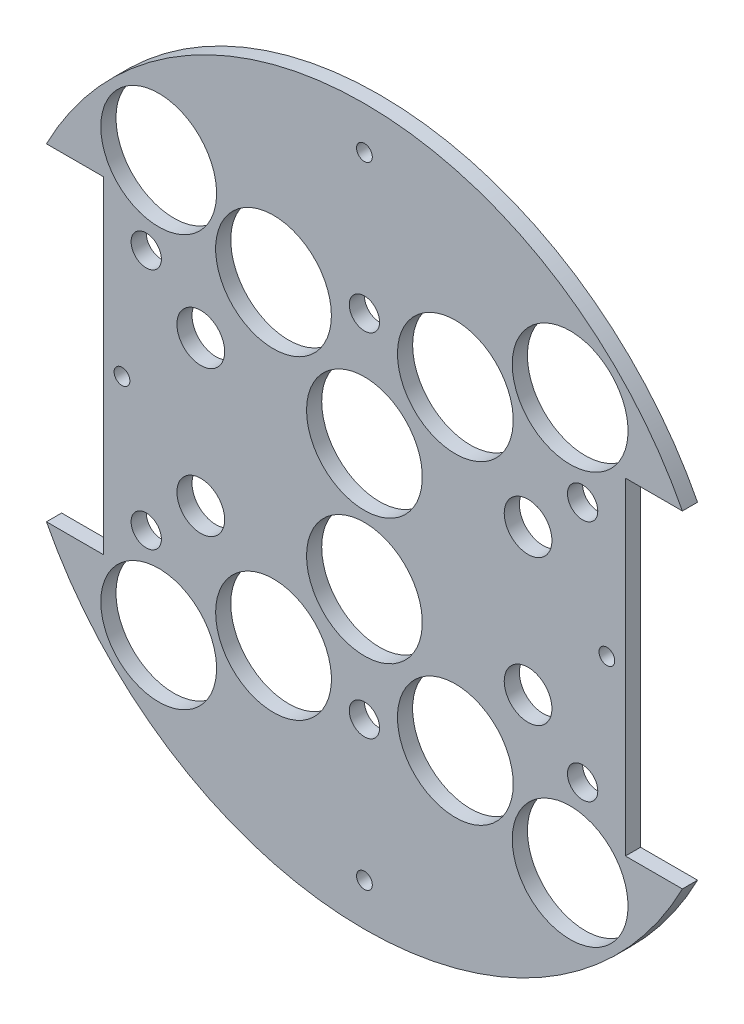
ISO-10303-21;
HEADER;
FILE_DESCRIPTION(('STEP AP214'),'2;1');
FILE_NAME('part.step','',(''),(''),'','','');
FILE_SCHEMA(('AUTOMOTIVE_DESIGN { 1 0 10303 214 1 1 1 1 }'));
ENDSEC;
DATA;
#1=APPLICATION_CONTEXT('core data for automotive mechanical design processes');
#2=APPLICATION_PROTOCOL_DEFINITION('international standard','automotive_design',2000,#1);
#3=PRODUCT_CONTEXT('',#1,'mechanical');
#4=PRODUCT('Part','Part','',(#3));
#5=PRODUCT_RELATED_PRODUCT_CATEGORY('part','',(#4));
#6=PRODUCT_DEFINITION_FORMATION('','',#4);
#7=PRODUCT_DEFINITION_CONTEXT('part definition',#1,'design');
#8=PRODUCT_DEFINITION('design','',#6,#7);
#9=PRODUCT_DEFINITION_SHAPE('','',#8);
#10=(LENGTH_UNIT() NAMED_UNIT(*) SI_UNIT(.MILLI.,.METRE.));
#11=(NAMED_UNIT(*) PLANE_ANGLE_UNIT() SI_UNIT($,.RADIAN.));
#12=(NAMED_UNIT(*) SI_UNIT($,.STERADIAN.) SOLID_ANGLE_UNIT());
#13=UNCERTAINTY_MEASURE_WITH_UNIT(LENGTH_MEASURE(1.E-05),#10,'distance_accuracy_value','');
#14=(GEOMETRIC_REPRESENTATION_CONTEXT(3) GLOBAL_UNCERTAINTY_ASSIGNED_CONTEXT((#13)) GLOBAL_UNIT_ASSIGNED_CONTEXT((#10,
#11,#12)) REPRESENTATION_CONTEXT('',''));
#15=CARTESIAN_POINT('',(0.,0.,0.));
#16=DIRECTION('',(0.,0.,1.));
#17=DIRECTION('',(1.,0.,0.));
#18=AXIS2_PLACEMENT_3D('',#15,#16,#17);
#19=CARTESIAN_POINT('',(0.,0.,3.175));
#20=DIRECTION('',(0.,0.,1.));
#21=DIRECTION('',(1.,0.,0.));
#22=AXIS2_PLACEMENT_3D('',#19,#20,#21);
#23=PLANE('',#22);
#24=CARTESIAN_POINT('',(0.,-66.04,3.175));
#25=DIRECTION('',(0.,0.,1.));
#26=DIRECTION('',(1.,0.,0.));
#27=AXIS2_PLACEMENT_3D('',#24,#25,#26);
#28=CIRCLE('',#27,1.65100000000002);
#29=CARTESIAN_POINT('',(1.65100000000002,-66.04,3.175));
#30=VERTEX_POINT('',#29);
#31=EDGE_CURVE('E161',#30,#30,#28,.T.);
#32=ORIENTED_EDGE('',*,*,#31,.F.);
#33=EDGE_LOOP('',(#32));
#34=FACE_BOUND('',#33,.T.);
#35=CARTESIAN_POINT('',(-50.8,0.,3.175));
#36=DIRECTION('',(0.,0.,1.));
#37=DIRECTION('',(1.,0.,0.));
#38=AXIS2_PLACEMENT_3D('',#35,#36,#37);
#39=CIRCLE('',#38,1.65100000000002);
#40=CARTESIAN_POINT('',(-49.149,0.,3.175));
#41=VERTEX_POINT('',#40);
#42=EDGE_CURVE('E167',#41,#41,#39,.T.);
#43=ORIENTED_EDGE('',*,*,#42,.F.);
#44=EDGE_LOOP('',(#43));
#45=FACE_BOUND('',#44,.T.);
#46=CARTESIAN_POINT('',(50.8,0.,3.175));
#47=DIRECTION('',(0.,0.,1.));
#48=DIRECTION('',(1.,0.,0.));
#49=AXIS2_PLACEMENT_3D('',#46,#47,#48);
#50=CIRCLE('',#49,1.65100000000002);
#51=CARTESIAN_POINT('',(52.451,0.,3.175));
#52=VERTEX_POINT('',#51);
#53=EDGE_CURVE('E164',#52,#52,#50,.T.);
#54=ORIENTED_EDGE('',*,*,#53,.F.);
#55=EDGE_LOOP('',(#54));
#56=FACE_BOUND('',#55,.T.);
#57=CARTESIAN_POINT('',(0.,66.04,3.175));
#58=DIRECTION('',(0.,0.,1.));
#59=DIRECTION('',(1.,0.,0.));
#60=AXIS2_PLACEMENT_3D('',#57,#58,#59);
#61=CIRCLE('',#60,1.65100000000002);
#62=CARTESIAN_POINT('',(1.65100000000002,66.04,3.175));
#63=VERTEX_POINT('',#62);
#64=EDGE_CURVE('E160',#63,#63,#61,.T.);
#65=ORIENTED_EDGE('',*,*,#64,.F.);
#66=EDGE_LOOP('',(#65));
#67=FACE_BOUND('',#66,.T.);
#68=CARTESIAN_POINT('',(0.,36.8300000000001,3.175));
#69=DIRECTION('',(0.,0.,1.));
#70=DIRECTION('',(1.,0.,0.));
#71=AXIS2_PLACEMENT_3D('',#68,#69,#70);
#72=CIRCLE('',#71,3.175);
#73=CARTESIAN_POINT('',(3.17499999999999,36.8300000000001,3.175));
#74=VERTEX_POINT('',#73);
#75=EDGE_CURVE('E208',#74,#74,#72,.T.);
#76=ORIENTED_EDGE('',*,*,#75,.F.);
#77=EDGE_LOOP('',(#76));
#78=FACE_BOUND('',#77,.T.);
#79=CARTESIAN_POINT('',(-45.72,25.4,3.175));
#80=DIRECTION('',(0.,0.,1.));
#81=DIRECTION('',(1.,0.,0.));
#82=AXIS2_PLACEMENT_3D('',#79,#80,#81);
#83=CIRCLE('',#82,3.175);
#84=CARTESIAN_POINT('',(-42.545,25.4,3.175));
#85=VERTEX_POINT('',#84);
#86=EDGE_CURVE('E205',#85,#85,#83,.T.);
#87=ORIENTED_EDGE('',*,*,#86,.F.);
#88=EDGE_LOOP('',(#87));
#89=FACE_BOUND('',#88,.T.);
#90=CARTESIAN_POINT('',(-45.72,-25.3999999999999,3.175));
#91=DIRECTION('',(0.,0.,1.));
#92=DIRECTION('',(1.,0.,0.));
#93=AXIS2_PLACEMENT_3D('',#90,#91,#92);
#94=CIRCLE('',#93,3.175);
#95=CARTESIAN_POINT('',(-42.545,-25.3999999999999,3.175));
#96=VERTEX_POINT('',#95);
#97=EDGE_CURVE('E202',#96,#96,#94,.T.);
#98=ORIENTED_EDGE('',*,*,#97,.F.);
#99=EDGE_LOOP('',(#98));
#100=FACE_BOUND('',#99,.T.);
#101=CARTESIAN_POINT('',(0.,-36.8299999999999,3.175));
#102=DIRECTION('',(0.,0.,1.));
#103=DIRECTION('',(1.,0.,0.));
#104=AXIS2_PLACEMENT_3D('',#101,#102,#103);
#105=CIRCLE('',#104,3.175);
#106=CARTESIAN_POINT('',(3.17499999999999,-36.8299999999999,3.175));
#107=VERTEX_POINT('',#106);
#108=EDGE_CURVE('E199',#107,#107,#105,.T.);
#109=ORIENTED_EDGE('',*,*,#108,.F.);
#110=EDGE_LOOP('',(#109));
#111=FACE_BOUND('',#110,.T.);
#112=CARTESIAN_POINT('',(45.72,-25.3999999999999,3.175));
#113=DIRECTION('',(0.,0.,1.));
#114=DIRECTION('',(1.,0.,0.));
#115=AXIS2_PLACEMENT_3D('',#112,#113,#114);
#116=CIRCLE('',#115,3.175);
#117=CARTESIAN_POINT('',(48.895,-25.3999999999999,3.175));
#118=VERTEX_POINT('',#117);
#119=EDGE_CURVE('E185',#118,#118,#116,.T.);
#120=ORIENTED_EDGE('',*,*,#119,.F.);
#121=EDGE_LOOP('',(#120));
#122=FACE_BOUND('',#121,.T.);
#123=CARTESIAN_POINT('',(45.72,25.4,3.175));
#124=DIRECTION('',(0.,0.,1.));
#125=DIRECTION('',(1.,0.,0.));
#126=AXIS2_PLACEMENT_3D('',#123,#124,#125);
#127=CIRCLE('',#126,3.175);
#128=CARTESIAN_POINT('',(48.895,25.4,3.175));
#129=VERTEX_POINT('',#128);
#130=EDGE_CURVE('E214',#129,#129,#127,.T.);
#131=ORIENTED_EDGE('',*,*,#130,.F.);
#132=EDGE_LOOP('',(#131));
#133=FACE_BOUND('',#132,.T.);
#134=CARTESIAN_POINT('',(34.29,-15.24,3.175));
#135=DIRECTION('',(0.,0.,-1.));
#136=DIRECTION('',(-1.,0.,0.));
#137=AXIS2_PLACEMENT_3D('',#134,#135,#136);
#138=CIRCLE('',#137,5.);
#139=CARTESIAN_POINT('',(29.29,-15.24,3.175));
#140=VERTEX_POINT('',#139);
#141=EDGE_CURVE('E218',#140,#140,#138,.T.);
#142=ORIENTED_EDGE('',*,*,#141,.T.);
#143=EDGE_LOOP('',(#142));
#144=FACE_BOUND('',#143,.T.);
#145=CARTESIAN_POINT('',(-34.29,15.24,3.175));
#146=DIRECTION('',(0.,0.,-1.));
#147=DIRECTION('',(-1.,0.,0.));
#148=AXIS2_PLACEMENT_3D('',#145,#146,#147);
#149=CIRCLE('',#148,5.);
#150=CARTESIAN_POINT('',(-39.29,15.24,3.175));
#151=VERTEX_POINT('',#150);
#152=EDGE_CURVE('E225',#151,#151,#149,.T.);
#153=ORIENTED_EDGE('',*,*,#152,.T.);
#154=EDGE_LOOP('',(#153));
#155=FACE_BOUND('',#154,.T.);
#156=CARTESIAN_POINT('',(34.29,15.24,3.175));
#157=DIRECTION('',(0.,0.,-1.));
#158=DIRECTION('',(-1.,0.,0.));
#159=AXIS2_PLACEMENT_3D('',#156,#157,#158);
#160=CIRCLE('',#159,5.);
#161=CARTESIAN_POINT('',(29.29,15.24,3.175));
#162=VERTEX_POINT('',#161);
#163=EDGE_CURVE('E231',#162,#162,#160,.T.);
#164=ORIENTED_EDGE('',*,*,#163,.T.);
#165=EDGE_LOOP('',(#164));
#166=FACE_BOUND('',#165,.T.);
#167=CARTESIAN_POINT('',(-34.29,-15.24,3.175));
#168=DIRECTION('',(0.,0.,-1.));
#169=DIRECTION('',(-1.,0.,0.));
#170=AXIS2_PLACEMENT_3D('',#167,#168,#169);
#171=CIRCLE('',#170,5.);
#172=CARTESIAN_POINT('',(-39.29,-15.24,3.175));
#173=VERTEX_POINT('',#172);
#174=EDGE_CURVE('E236',#173,#173,#171,.T.);
#175=ORIENTED_EDGE('',*,*,#174,.T.);
#176=EDGE_LOOP('',(#175));
#177=FACE_BOUND('',#176,.T.);
#178=CARTESIAN_POINT('',(-43.1052293811319,43.105229381132,3.175));
#179=DIRECTION('',(0.,0.,-1.));
#180=DIRECTION('',(-1.,0.,0.));
#181=AXIS2_PLACEMENT_3D('',#178,#179,#180);
#182=CIRCLE('',#181,12.1285);
#183=CARTESIAN_POINT('',(-55.2337293811319,43.105229381132,3.175));
#184=VERTEX_POINT('',#183);
#185=EDGE_CURVE('E260',#184,#184,#182,.T.);
#186=ORIENTED_EDGE('',*,*,#185,.T.);
#187=EDGE_LOOP('',(#186));
#188=FACE_BOUND('',#187,.T.);
#189=CARTESIAN_POINT('',(19.0500000000001,-32.9955678841871,3.175));
#190=DIRECTION('',(0.,0.,-1.));
#191=DIRECTION('',(1.,0.,0.));
#192=AXIS2_PLACEMENT_3D('',#189,#190,#191);
#193=CIRCLE('',#192,12.1285);
#194=CARTESIAN_POINT('',(31.1785000000001,-32.9955678841871,3.175));
#195=VERTEX_POINT('',#194);
#196=EDGE_CURVE('E267',#195,#195,#193,.T.);
#197=ORIENTED_EDGE('',*,*,#196,.T.);
#198=EDGE_LOOP('',(#197));
#199=FACE_BOUND('',#198,.T.);
#200=CARTESIAN_POINT('',(-43.105229381132,-43.1052293811318,3.175));
#201=DIRECTION('',(0.,0.,-1.));
#202=DIRECTION('',(-1.,0.,0.));
#203=AXIS2_PLACEMENT_3D('',#200,#201,#202);
#204=CIRCLE('',#203,12.1285);
#205=CARTESIAN_POINT('',(-55.233729381132,-43.1052293811318,3.175));
#206=VERTEX_POINT('',#205);
#207=EDGE_CURVE('E249',#206,#206,#204,.T.);
#208=ORIENTED_EDGE('',*,*,#207,.T.);
#209=EDGE_LOOP('',(#208));
#210=FACE_BOUND('',#209,.T.);
#211=CARTESIAN_POINT('',(0.,13.208,3.175));
#212=DIRECTION('',(0.,0.,-1.));
#213=DIRECTION('',(-1.,0.,0.));
#214=AXIS2_PLACEMENT_3D('',#211,#212,#213);
#215=CIRCLE('',#214,12.1285);
#216=CARTESIAN_POINT('',(-12.1285,13.208,3.175));
#217=VERTEX_POINT('',#216);
#218=EDGE_CURVE('E242',#217,#217,#215,.T.);
#219=ORIENTED_EDGE('',*,*,#218,.T.);
#220=EDGE_LOOP('',(#219));
#221=FACE_BOUND('',#220,.T.);
#222=CARTESIAN_POINT('',(0.,-13.208,3.175));
#223=DIRECTION('',(0.,0.,-1.));
#224=DIRECTION('',(-1.,0.,0.));
#225=AXIS2_PLACEMENT_3D('',#222,#223,#224);
#226=CIRCLE('',#225,12.1285);
#227=CARTESIAN_POINT('',(-12.1285,-13.208,3.175));
#228=VERTEX_POINT('',#227);
#229=EDGE_CURVE('E254',#228,#228,#226,.T.);
#230=ORIENTED_EDGE('',*,*,#229,.T.);
#231=EDGE_LOOP('',(#230));
#232=FACE_BOUND('',#231,.T.);
#233=CARTESIAN_POINT('',(43.1052293811319,-43.105229381132,3.175));
#234=DIRECTION('',(0.,0.,-1.));
#235=DIRECTION('',(-1.,0.,0.));
#236=AXIS2_PLACEMENT_3D('',#233,#234,#235);
#237=CIRCLE('',#236,12.1285);
#238=CARTESIAN_POINT('',(30.9767293811319,-43.105229381132,3.175));
#239=VERTEX_POINT('',#238);
#240=EDGE_CURVE('E284',#239,#239,#237,.T.);
#241=ORIENTED_EDGE('',*,*,#240,.T.);
#242=EDGE_LOOP('',(#241));
#243=FACE_BOUND('',#242,.T.);
#244=CARTESIAN_POINT('',(-19.0500000000001,32.9955678841871,3.175));
#245=DIRECTION('',(0.,0.,-1.));
#246=DIRECTION('',(1.,0.,0.));
#247=AXIS2_PLACEMENT_3D('',#244,#245,#246);
#248=CIRCLE('',#247,12.1285);
#249=CARTESIAN_POINT('',(-6.92150000000005,32.9955678841871,3.175));
#250=VERTEX_POINT('',#249);
#251=EDGE_CURVE('E291',#250,#250,#248,.T.);
#252=ORIENTED_EDGE('',*,*,#251,.T.);
#253=EDGE_LOOP('',(#252));
#254=FACE_BOUND('',#253,.T.);
#255=CARTESIAN_POINT('',(43.105229381132,43.1052293811319,3.175));
#256=DIRECTION('',(0.,0.,-1.));
#257=DIRECTION('',(-1.,0.,0.));
#258=AXIS2_PLACEMENT_3D('',#255,#256,#257);
#259=CIRCLE('',#258,12.1285);
#260=CARTESIAN_POINT('',(30.976729381132,43.1052293811319,3.175));
#261=VERTEX_POINT('',#260);
#262=EDGE_CURVE('E272',#261,#261,#259,.T.);
#263=ORIENTED_EDGE('',*,*,#262,.T.);
#264=EDGE_LOOP('',(#263));
#265=FACE_BOUND('',#264,.T.);
#266=CARTESIAN_POINT('',(19.0500000000001,32.9955678841871,3.175));
#267=DIRECTION('',(0.,0.,-1.));
#268=DIRECTION('',(-1.,0.,0.));
#269=AXIS2_PLACEMENT_3D('',#266,#267,#268);
#270=CIRCLE('',#269,12.1285);
#271=CARTESIAN_POINT('',(6.92150000000005,32.9955678841871,3.175));
#272=VERTEX_POINT('',#271);
#273=EDGE_CURVE('E278',#272,#272,#270,.T.);
#274=ORIENTED_EDGE('',*,*,#273,.T.);
#275=EDGE_LOOP('',(#274));
#276=FACE_BOUND('',#275,.T.);
#277=CARTESIAN_POINT('',(-19.0500000000001,-32.9955678841871,3.175));
#278=DIRECTION('',(0.,0.,-1.));
#279=DIRECTION('',(-1.,0.,0.));
#280=AXIS2_PLACEMENT_3D('',#277,#278,#279);
#281=CIRCLE('',#280,12.1285);
#282=CARTESIAN_POINT('',(-31.1785000000001,-32.9955678841871,3.175));
#283=VERTEX_POINT('',#282);
#284=EDGE_CURVE('E134',#283,#283,#281,.T.);
#285=ORIENTED_EDGE('',*,*,#284,.T.);
#286=EDGE_LOOP('',(#285));
#287=FACE_BOUND('',#286,.T.);
#288=CARTESIAN_POINT('',(0.,0.,3.175));
#289=DIRECTION('',(0.,0.,1.));
#290=DIRECTION('',(1.,0.,0.));
#291=AXIS2_PLACEMENT_3D('',#288,#289,#290);
#292=CIRCLE('',#291,74.93);
#293=CARTESIAN_POINT('',(66.6235754069083,34.29,3.175));
#294=VERTEX_POINT('',#293);
#295=CARTESIAN_POINT('',(-66.6235754069083,34.29,3.175));
#296=VERTEX_POINT('',#295);
#297=EDGE_CURVE('E145',#294,#296,#292,.T.);
#298=ORIENTED_EDGE('',*,*,#297,.T.);
#299=DIRECTION('',(1.,0.,0.));
#300=VECTOR('',#299,1.);
#301=CARTESIAN_POINT('',(-66.6235754069083,34.29,3.175));
#302=LINE('',#301,#300);
#303=CARTESIAN_POINT('',(-54.6855754069083,34.29,3.175));
#304=VERTEX_POINT('',#303);
#305=EDGE_CURVE('E94',#296,#304,#302,.T.);
#306=ORIENTED_EDGE('',*,*,#305,.T.);
#307=DIRECTION('',(0.,-1.,0.));
#308=VECTOR('',#307,1.);
#309=CARTESIAN_POINT('',(-54.6855754069083,34.29,3.175));
#310=LINE('',#309,#308);
#311=CARTESIAN_POINT('',(-54.6855754069083,-34.29,3.175));
#312=VERTEX_POINT('',#311);
#313=EDGE_CURVE('E302',#304,#312,#310,.T.);
#314=ORIENTED_EDGE('',*,*,#313,.T.);
#315=DIRECTION('',(-1.,0.,0.));
#316=VECTOR('',#315,1.);
#317=CARTESIAN_POINT('',(-66.6235754069083,-34.29,3.175));
#318=LINE('',#317,#316);
#319=CARTESIAN_POINT('',(-66.6235754069083,-34.29,3.175));
#320=VERTEX_POINT('',#319);
#321=EDGE_CURVE('E304',#312,#320,#318,.T.);
#322=ORIENTED_EDGE('',*,*,#321,.T.);
#323=CARTESIAN_POINT('',(0.,0.,3.175));
#324=DIRECTION('',(0.,0.,1.));
#325=DIRECTION('',(1.,0.,0.));
#326=AXIS2_PLACEMENT_3D('',#323,#324,#325);
#327=CIRCLE('',#326,74.93);
#328=CARTESIAN_POINT('',(66.6235754069083,-34.2900000000001,3.175));
#329=VERTEX_POINT('',#328);
#330=EDGE_CURVE('E112',#320,#329,#327,.T.);
#331=ORIENTED_EDGE('',*,*,#330,.T.);
#332=DIRECTION('',(-1.,0.,0.));
#333=VECTOR('',#332,1.);
#334=CARTESIAN_POINT('',(66.6235754069083,-34.29,3.175));
#335=LINE('',#334,#333);
#336=CARTESIAN_POINT('',(54.6855754069083,-34.29,3.175));
#337=VERTEX_POINT('',#336);
#338=EDGE_CURVE('E107',#329,#337,#335,.T.);
#339=ORIENTED_EDGE('',*,*,#338,.T.);
#340=DIRECTION('',(0.,1.,0.));
#341=VECTOR('',#340,1.);
#342=CARTESIAN_POINT('',(54.6855754069083,34.29,3.175));
#343=LINE('',#342,#341);
#344=CARTESIAN_POINT('',(54.6855754069083,34.29,3.175));
#345=VERTEX_POINT('',#344);
#346=EDGE_CURVE('E110',#337,#345,#343,.T.);
#347=ORIENTED_EDGE('',*,*,#346,.T.);
#348=DIRECTION('',(1.,0.,0.));
#349=VECTOR('',#348,1.);
#350=CARTESIAN_POINT('',(66.6235754069083,34.29,3.175));
#351=LINE('',#350,#349);
#352=EDGE_CURVE('E51',#345,#294,#351,.T.);
#353=ORIENTED_EDGE('',*,*,#352,.T.);
#354=EDGE_LOOP('',(#298,#306,#314,#322,#331,#339,#347,#353));
#355=FACE_BOUND('',#354,.T.);
#356=ADVANCED_FACE('F32',(#34,#45,#56,#67,#78,#89,#100,#111,#122,#133,#144,#155,#166,#177,#188,
#199,#210,#221,#232,#243,#254,#265,#276,#287,#355),#23,.T.);
#357=CARTESIAN_POINT('',(0.,0.,0.));
#358=DIRECTION('',(0.,0.,1.));
#359=DIRECTION('',(1.,0.,0.));
#360=AXIS2_PLACEMENT_3D('',#357,#358,#359);
#361=PLANE('',#360);
#362=CARTESIAN_POINT('',(0.,-66.04,0.));
#363=DIRECTION('',(0.,0.,1.));
#364=DIRECTION('',(1.,0.,0.));
#365=AXIS2_PLACEMENT_3D('',#362,#363,#364);
#366=CIRCLE('',#365,1.65100000000002);
#367=CARTESIAN_POINT('',(1.65100000000002,-66.04,0.));
#368=VERTEX_POINT('',#367);
#369=EDGE_CURVE('E36',#368,#368,#366,.T.);
#370=ORIENTED_EDGE('',*,*,#369,.T.);
#371=EDGE_LOOP('',(#370));
#372=FACE_BOUND('',#371,.T.);
#373=CARTESIAN_POINT('',(-50.8,0.,0.));
#374=DIRECTION('',(0.,0.,1.));
#375=DIRECTION('',(1.,0.,0.));
#376=AXIS2_PLACEMENT_3D('',#373,#374,#375);
#377=CIRCLE('',#376,1.65100000000002);
#378=CARTESIAN_POINT('',(-49.149,0.,0.));
#379=VERTEX_POINT('',#378);
#380=EDGE_CURVE('E165',#379,#379,#377,.T.);
#381=ORIENTED_EDGE('',*,*,#380,.T.);
#382=EDGE_LOOP('',(#381));
#383=FACE_BOUND('',#382,.T.);
#384=CARTESIAN_POINT('',(50.8,0.,0.));
#385=DIRECTION('',(0.,0.,1.));
#386=DIRECTION('',(1.,0.,0.));
#387=AXIS2_PLACEMENT_3D('',#384,#385,#386);
#388=CIRCLE('',#387,1.65100000000002);
#389=CARTESIAN_POINT('',(52.451,0.,0.));
#390=VERTEX_POINT('',#389);
#391=EDGE_CURVE('E162',#390,#390,#388,.T.);
#392=ORIENTED_EDGE('',*,*,#391,.T.);
#393=EDGE_LOOP('',(#392));
#394=FACE_BOUND('',#393,.T.);
#395=CARTESIAN_POINT('',(0.,66.04,0.));
#396=DIRECTION('',(0.,0.,1.));
#397=DIRECTION('',(1.,0.,0.));
#398=AXIS2_PLACEMENT_3D('',#395,#396,#397);
#399=CIRCLE('',#398,1.65100000000002);
#400=CARTESIAN_POINT('',(1.65100000000002,66.04,0.));
#401=VERTEX_POINT('',#400);
#402=EDGE_CURVE('E157',#401,#401,#399,.T.);
#403=ORIENTED_EDGE('',*,*,#402,.T.);
#404=EDGE_LOOP('',(#403));
#405=FACE_BOUND('',#404,.T.);
#406=CARTESIAN_POINT('',(0.,36.8300000000001,0.));
#407=DIRECTION('',(0.,0.,1.));
#408=DIRECTION('',(1.,0.,0.));
#409=AXIS2_PLACEMENT_3D('',#406,#407,#408);
#410=CIRCLE('',#409,3.175);
#411=CARTESIAN_POINT('',(3.17499999999999,36.8300000000001,0.));
#412=VERTEX_POINT('',#411);
#413=EDGE_CURVE('E182',#412,#412,#410,.T.);
#414=ORIENTED_EDGE('',*,*,#413,.T.);
#415=EDGE_LOOP('',(#414));
#416=FACE_BOUND('',#415,.T.);
#417=CARTESIAN_POINT('',(-45.72,25.4,0.));
#418=DIRECTION('',(0.,0.,1.));
#419=DIRECTION('',(-1.,0.,0.));
#420=AXIS2_PLACEMENT_3D('',#417,#418,#419);
#421=CIRCLE('',#420,3.175);
#422=CARTESIAN_POINT('',(-48.895,25.4,0.));
#423=VERTEX_POINT('',#422);
#424=EDGE_CURVE('E186',#423,#423,#421,.T.);
#425=ORIENTED_EDGE('',*,*,#424,.T.);
#426=EDGE_LOOP('',(#425));
#427=FACE_BOUND('',#426,.T.);
#428=CARTESIAN_POINT('',(-45.72,-25.3999999999999,0.));
#429=DIRECTION('',(0.,0.,1.));
#430=DIRECTION('',(1.,0.,0.));
#431=AXIS2_PLACEMENT_3D('',#428,#429,#430);
#432=CIRCLE('',#431,3.175);
#433=CARTESIAN_POINT('',(-42.545,-25.3999999999999,0.));
#434=VERTEX_POINT('',#433);
#435=EDGE_CURVE('E189',#434,#434,#432,.T.);
#436=ORIENTED_EDGE('',*,*,#435,.T.);
#437=EDGE_LOOP('',(#436));
#438=FACE_BOUND('',#437,.T.);
#439=CARTESIAN_POINT('',(0.,-36.8299999999999,0.));
#440=DIRECTION('',(0.,0.,1.));
#441=DIRECTION('',(-1.,0.,0.));
#442=AXIS2_PLACEMENT_3D('',#439,#440,#441);
#443=CIRCLE('',#442,3.175);
#444=CARTESIAN_POINT('',(-3.17500000000001,-36.8299999999999,0.));
#445=VERTEX_POINT('',#444);
#446=EDGE_CURVE('E192',#445,#445,#443,.T.);
#447=ORIENTED_EDGE('',*,*,#446,.T.);
#448=EDGE_LOOP('',(#447));
#449=FACE_BOUND('',#448,.T.);
#450=CARTESIAN_POINT('',(45.72,-25.3999999999999,0.));
#451=DIRECTION('',(0.,0.,1.));
#452=DIRECTION('',(-1.,0.,0.));
#453=AXIS2_PLACEMENT_3D('',#450,#451,#452);
#454=CIRCLE('',#453,3.175);
#455=CARTESIAN_POINT('',(42.545,-25.3999999999999,0.));
#456=VERTEX_POINT('',#455);
#457=EDGE_CURVE('E181',#456,#456,#454,.T.);
#458=ORIENTED_EDGE('',*,*,#457,.T.);
#459=EDGE_LOOP('',(#458));
#460=FACE_BOUND('',#459,.T.);
#461=CARTESIAN_POINT('',(45.72,25.4,0.));
#462=DIRECTION('',(0.,0.,1.));
#463=DIRECTION('',(1.,0.,0.));
#464=AXIS2_PLACEMENT_3D('',#461,#462,#463);
#465=CIRCLE('',#464,3.175);
#466=CARTESIAN_POINT('',(48.895,25.4,0.));
#467=VERTEX_POINT('',#466);
#468=EDGE_CURVE('E211',#467,#467,#465,.T.);
#469=ORIENTED_EDGE('',*,*,#468,.T.);
#470=EDGE_LOOP('',(#469));
#471=FACE_BOUND('',#470,.T.);
#472=CARTESIAN_POINT('',(34.29,-15.24,0.));
#473=DIRECTION('',(0.,0.,-1.));
#474=DIRECTION('',(-1.,0.,0.));
#475=AXIS2_PLACEMENT_3D('',#472,#473,#474);
#476=CIRCLE('',#475,5.);
#477=CARTESIAN_POINT('',(29.29,-15.24,0.));
#478=VERTEX_POINT('',#477);
#479=EDGE_CURVE('E222',#478,#478,#476,.T.);
#480=ORIENTED_EDGE('',*,*,#479,.F.);
#481=EDGE_LOOP('',(#480));
#482=FACE_BOUND('',#481,.T.);
#483=CARTESIAN_POINT('',(-34.29,15.24,0.));
#484=DIRECTION('',(0.,0.,-1.));
#485=DIRECTION('',(-1.,0.,0.));
#486=AXIS2_PLACEMENT_3D('',#483,#484,#485);
#487=CIRCLE('',#486,5.);
#488=CARTESIAN_POINT('',(-39.29,15.24,0.));
#489=VERTEX_POINT('',#488);
#490=EDGE_CURVE('E228',#489,#489,#487,.T.);
#491=ORIENTED_EDGE('',*,*,#490,.F.);
#492=EDGE_LOOP('',(#491));
#493=FACE_BOUND('',#492,.T.);
#494=CARTESIAN_POINT('',(34.29,15.24,0.));
#495=DIRECTION('',(0.,0.,-1.));
#496=DIRECTION('',(-1.,0.,0.));
#497=AXIS2_PLACEMENT_3D('',#494,#495,#496);
#498=CIRCLE('',#497,5.);
#499=CARTESIAN_POINT('',(29.29,15.24,0.));
#500=VERTEX_POINT('',#499);
#501=EDGE_CURVE('E217',#500,#500,#498,.T.);
#502=ORIENTED_EDGE('',*,*,#501,.F.);
#503=EDGE_LOOP('',(#502));
#504=FACE_BOUND('',#503,.T.);
#505=CARTESIAN_POINT('',(-34.29,-15.24,0.));
#506=DIRECTION('',(0.,0.,-1.));
#507=DIRECTION('',(-1.,0.,0.));
#508=AXIS2_PLACEMENT_3D('',#505,#506,#507);
#509=CIRCLE('',#508,5.);
#510=CARTESIAN_POINT('',(-39.29,-15.24,0.));
#511=VERTEX_POINT('',#510);
#512=EDGE_CURVE('E221',#511,#511,#509,.T.);
#513=ORIENTED_EDGE('',*,*,#512,.F.);
#514=EDGE_LOOP('',(#513));
#515=FACE_BOUND('',#514,.T.);
#516=CARTESIAN_POINT('',(-43.1052293811319,43.105229381132,0.));
#517=DIRECTION('',(0.,0.,-1.));
#518=DIRECTION('',(-1.,0.,0.));
#519=AXIS2_PLACEMENT_3D('',#516,#517,#518);
#520=CIRCLE('',#519,12.1285);
#521=CARTESIAN_POINT('',(-55.2337293811319,43.105229381132,0.));
#522=VERTEX_POINT('',#521);
#523=EDGE_CURVE('E264',#522,#522,#520,.T.);
#524=ORIENTED_EDGE('',*,*,#523,.F.);
#525=EDGE_LOOP('',(#524));
#526=FACE_BOUND('',#525,.T.);
#527=CARTESIAN_POINT('',(19.0500000000001,-32.9955678841871,0.));
#528=DIRECTION('',(0.,0.,-1.));
#529=DIRECTION('',(1.,0.,0.));
#530=AXIS2_PLACEMENT_3D('',#527,#528,#529);
#531=CIRCLE('',#530,12.1285);
#532=CARTESIAN_POINT('',(31.1785000000001,-32.9955678841871,0.));
#533=VERTEX_POINT('',#532);
#534=EDGE_CURVE('E257',#533,#533,#531,.T.);
#535=ORIENTED_EDGE('',*,*,#534,.F.);
#536=EDGE_LOOP('',(#535));
#537=FACE_BOUND('',#536,.T.);
#538=CARTESIAN_POINT('',(-43.105229381132,-43.1052293811318,0.));
#539=DIRECTION('',(0.,0.,-1.));
#540=DIRECTION('',(-1.,0.,0.));
#541=AXIS2_PLACEMENT_3D('',#538,#539,#540);
#542=CIRCLE('',#541,12.1285);
#543=CARTESIAN_POINT('',(-55.233729381132,-43.1052293811318,0.));
#544=VERTEX_POINT('',#543);
#545=EDGE_CURVE('E239',#544,#544,#542,.T.);
#546=ORIENTED_EDGE('',*,*,#545,.F.);
#547=EDGE_LOOP('',(#546));
#548=FACE_BOUND('',#547,.T.);
#549=CARTESIAN_POINT('',(0.,13.208,0.));
#550=DIRECTION('',(0.,0.,-1.));
#551=DIRECTION('',(-1.,0.,0.));
#552=AXIS2_PLACEMENT_3D('',#549,#550,#551);
#553=CIRCLE('',#552,12.1285);
#554=CARTESIAN_POINT('',(-12.1285,13.208,0.));
#555=VERTEX_POINT('',#554);
#556=EDGE_CURVE('E246',#555,#555,#553,.T.);
#557=ORIENTED_EDGE('',*,*,#556,.F.);
#558=EDGE_LOOP('',(#557));
#559=FACE_BOUND('',#558,.T.);
#560=CARTESIAN_POINT('',(0.,-13.208,0.));
#561=DIRECTION('',(0.,0.,-1.));
#562=DIRECTION('',(-1.,0.,0.));
#563=AXIS2_PLACEMENT_3D('',#560,#561,#562);
#564=CIRCLE('',#563,12.1285);
#565=CARTESIAN_POINT('',(-12.1285,-13.208,0.));
#566=VERTEX_POINT('',#565);
#567=EDGE_CURVE('E245',#566,#566,#564,.T.);
#568=ORIENTED_EDGE('',*,*,#567,.F.);
#569=EDGE_LOOP('',(#568));
#570=FACE_BOUND('',#569,.T.);
#571=CARTESIAN_POINT('',(43.1052293811319,-43.105229381132,0.));
#572=DIRECTION('',(0.,0.,-1.));
#573=DIRECTION('',(-1.,0.,0.));
#574=AXIS2_PLACEMENT_3D('',#571,#572,#573);
#575=CIRCLE('',#574,12.1285);
#576=CARTESIAN_POINT('',(30.9767293811319,-43.105229381132,0.));
#577=VERTEX_POINT('',#576);
#578=EDGE_CURVE('E288',#577,#577,#575,.T.);
#579=ORIENTED_EDGE('',*,*,#578,.F.);
#580=EDGE_LOOP('',(#579));
#581=FACE_BOUND('',#580,.T.);
#582=CARTESIAN_POINT('',(-19.0500000000001,32.9955678841871,0.));
#583=DIRECTION('',(0.,0.,-1.));
#584=DIRECTION('',(1.,0.,0.));
#585=AXIS2_PLACEMENT_3D('',#582,#583,#584);
#586=CIRCLE('',#585,12.1285);
#587=CARTESIAN_POINT('',(-6.92150000000005,32.9955678841871,0.));
#588=VERTEX_POINT('',#587);
#589=EDGE_CURVE('E281',#588,#588,#586,.T.);
#590=ORIENTED_EDGE('',*,*,#589,.F.);
#591=EDGE_LOOP('',(#590));
#592=FACE_BOUND('',#591,.T.);
#593=CARTESIAN_POINT('',(43.105229381132,43.1052293811319,0.));
#594=DIRECTION('',(0.,0.,-1.));
#595=DIRECTION('',(-1.,0.,0.));
#596=AXIS2_PLACEMENT_3D('',#593,#594,#595);
#597=CIRCLE('',#596,12.1285);
#598=CARTESIAN_POINT('',(30.976729381132,43.1052293811319,0.));
#599=VERTEX_POINT('',#598);
#600=EDGE_CURVE('E263',#599,#599,#597,.T.);
#601=ORIENTED_EDGE('',*,*,#600,.F.);
#602=EDGE_LOOP('',(#601));
#603=FACE_BOUND('',#602,.T.);
#604=CARTESIAN_POINT('',(19.0500000000001,32.9955678841871,0.));
#605=DIRECTION('',(0.,0.,-1.));
#606=DIRECTION('',(-1.,0.,0.));
#607=AXIS2_PLACEMENT_3D('',#604,#605,#606);
#608=CIRCLE('',#607,12.1285);
#609=CARTESIAN_POINT('',(6.92150000000005,32.9955678841871,0.));
#610=VERTEX_POINT('',#609);
#611=EDGE_CURVE('E275',#610,#610,#608,.T.);
#612=ORIENTED_EDGE('',*,*,#611,.F.);
#613=EDGE_LOOP('',(#612));
#614=FACE_BOUND('',#613,.T.);
#615=CARTESIAN_POINT('',(-19.0500000000001,-32.9955678841871,0.));
#616=DIRECTION('',(0.,0.,-1.));
#617=DIRECTION('',(-1.,0.,0.));
#618=AXIS2_PLACEMENT_3D('',#615,#616,#617);
#619=CIRCLE('',#618,12.1285);
#620=CARTESIAN_POINT('',(-31.1785000000001,-32.9955678841871,0.));
#621=VERTEX_POINT('',#620);
#622=EDGE_CURVE('E287',#621,#621,#619,.T.);
#623=ORIENTED_EDGE('',*,*,#622,.F.);
#624=EDGE_LOOP('',(#623));
#625=FACE_BOUND('',#624,.T.);
#626=CARTESIAN_POINT('',(0.,0.,0.));
#627=DIRECTION('',(0.,0.,1.));
#628=DIRECTION('',(1.,0.,0.));
#629=AXIS2_PLACEMENT_3D('',#626,#627,#628);
#630=CIRCLE('',#629,74.93);
#631=CARTESIAN_POINT('',(66.6235754069083,34.29,0.));
#632=VERTEX_POINT('',#631);
#633=CARTESIAN_POINT('',(-66.6235754069083,34.29,0.));
#634=VERTEX_POINT('',#633);
#635=EDGE_CURVE('E130',#632,#634,#630,.T.);
#636=ORIENTED_EDGE('',*,*,#635,.F.);
#637=DIRECTION('',(1.,0.,0.));
#638=VECTOR('',#637,1.);
#639=CARTESIAN_POINT('',(66.6235754069083,34.29,0.));
#640=LINE('',#639,#638);
#641=CARTESIAN_POINT('',(54.6855754069083,34.29,0.));
#642=VERTEX_POINT('',#641);
#643=EDGE_CURVE('E86',#642,#632,#640,.T.);
#644=ORIENTED_EDGE('',*,*,#643,.F.);
#645=DIRECTION('',(0.,1.,0.));
#646=VECTOR('',#645,1.);
#647=CARTESIAN_POINT('',(54.6855754069083,34.29,0.));
#648=LINE('',#647,#646);
#649=CARTESIAN_POINT('',(54.6855754069083,-34.29,0.));
#650=VERTEX_POINT('',#649);
#651=EDGE_CURVE('E80',#650,#642,#648,.T.);
#652=ORIENTED_EDGE('',*,*,#651,.F.);
#653=DIRECTION('',(-1.,0.,0.));
#654=VECTOR('',#653,1.);
#655=CARTESIAN_POINT('',(66.6235754069083,-34.29,0.));
#656=LINE('',#655,#654);
#657=CARTESIAN_POINT('',(66.6235754069083,-34.2900000000001,0.));
#658=VERTEX_POINT('',#657);
#659=EDGE_CURVE('E120',#658,#650,#656,.T.);
#660=ORIENTED_EDGE('',*,*,#659,.F.);
#661=CARTESIAN_POINT('',(0.,0.,0.));
#662=DIRECTION('',(0.,0.,1.));
#663=DIRECTION('',(1.,0.,0.));
#664=AXIS2_PLACEMENT_3D('',#661,#662,#663);
#665=CIRCLE('',#664,74.93);
#666=CARTESIAN_POINT('',(-66.6235754069083,-34.29,0.));
#667=VERTEX_POINT('',#666);
#668=EDGE_CURVE('E140',#667,#658,#665,.T.);
#669=ORIENTED_EDGE('',*,*,#668,.F.);
#670=DIRECTION('',(-1.,0.,0.));
#671=VECTOR('',#670,1.);
#672=CARTESIAN_POINT('',(-66.6235754069083,-34.29,0.));
#673=LINE('',#672,#671);
#674=CARTESIAN_POINT('',(-54.6855754069083,-34.29,0.));
#675=VERTEX_POINT('',#674);
#676=EDGE_CURVE('E138',#675,#667,#673,.T.);
#677=ORIENTED_EDGE('',*,*,#676,.F.);
#678=DIRECTION('',(0.,-1.,0.));
#679=VECTOR('',#678,1.);
#680=CARTESIAN_POINT('',(-54.6855754069083,34.29,0.));
#681=LINE('',#680,#679);
#682=CARTESIAN_POINT('',(-54.6855754069083,34.29,0.));
#683=VERTEX_POINT('',#682);
#684=EDGE_CURVE('E136',#683,#675,#681,.T.);
#685=ORIENTED_EDGE('',*,*,#684,.F.);
#686=DIRECTION('',(1.,0.,0.));
#687=VECTOR('',#686,1.);
#688=CARTESIAN_POINT('',(-66.6235754069083,34.29,0.));
#689=LINE('',#688,#687);
#690=EDGE_CURVE('E133',#634,#683,#689,.T.);
#691=ORIENTED_EDGE('',*,*,#690,.F.);
#692=EDGE_LOOP('',(#636,#644,#652,#660,#669,#677,#685,#691));
#693=FACE_BOUND('',#692,.T.);
#694=ADVANCED_FACE('F317',(#372,#383,#394,#405,#416,#427,#438,#449,#460,#471,#482,#493,#504,
#515,#526,#537,#548,#559,#570,#581,#592,#603,#614,#625,#693),#361,.F.);
#695=CARTESIAN_POINT('',(0.,0.,3.175));
#696=DIRECTION('',(0.,0.,-1.));
#697=DIRECTION('',(-1.,0.,0.));
#698=AXIS2_PLACEMENT_3D('',#695,#696,#697);
#699=CYLINDRICAL_SURFACE('',#698,74.93);
#700=ORIENTED_EDGE('',*,*,#635,.T.);
#701=DIRECTION('',(0.,0.,-1.));
#702=VECTOR('',#701,1.);
#703=CARTESIAN_POINT('',(-66.6235754069083,34.29,3.175));
#704=LINE('',#703,#702);
#705=EDGE_CURVE('E11',#296,#634,#704,.T.);
#706=ORIENTED_EDGE('',*,*,#705,.F.);
#707=ORIENTED_EDGE('',*,*,#297,.F.);
#708=DIRECTION('',(0.,0.,-1.));
#709=VECTOR('',#708,1.);
#710=CARTESIAN_POINT('',(66.6235754069083,34.29,3.175));
#711=LINE('',#710,#709);
#712=EDGE_CURVE('E126',#294,#632,#711,.T.);
#713=ORIENTED_EDGE('',*,*,#712,.T.);
#714=EDGE_LOOP('',(#700,#706,#707,#713));
#715=FACE_BOUND('',#714,.T.);
#716=ADVANCED_FACE('F34',(#715),#699,.T.);
#717=CARTESIAN_POINT('',(-66.6235754069083,34.29,3.175));
#718=DIRECTION('',(0.,1.,0.));
#719=DIRECTION('',(-1.,0.,0.));
#720=AXIS2_PLACEMENT_3D('',#717,#718,#719);
#721=PLANE('',#720);
#722=ORIENTED_EDGE('',*,*,#690,.T.);
#723=DIRECTION('',(0.,0.,-1.));
#724=VECTOR('',#723,1.);
#725=CARTESIAN_POINT('',(-54.6855754069083,34.29,3.175));
#726=LINE('',#725,#724);
#727=EDGE_CURVE('E42',#304,#683,#726,.T.);
#728=ORIENTED_EDGE('',*,*,#727,.F.);
#729=ORIENTED_EDGE('',*,*,#305,.F.);
#730=ORIENTED_EDGE('',*,*,#705,.T.);
#731=EDGE_LOOP('',(#722,#728,#729,#730));
#732=FACE_BOUND('',#731,.T.);
#733=ADVANCED_FACE('F641',(#732),#721,.F.);
#734=CARTESIAN_POINT('',(-54.6855754069083,34.29,3.175));
#735=DIRECTION('',(1.,0.,0.));
#736=DIRECTION('',(0.,1.,0.));
#737=AXIS2_PLACEMENT_3D('',#734,#735,#736);
#738=PLANE('',#737);
#739=ORIENTED_EDGE('',*,*,#684,.T.);
#740=DIRECTION('',(0.,0.,-1.));
#741=VECTOR('',#740,1.);
#742=CARTESIAN_POINT('',(-54.6855754069083,-34.29,3.175));
#743=LINE('',#742,#741);
#744=EDGE_CURVE('E152',#312,#675,#743,.T.);
#745=ORIENTED_EDGE('',*,*,#744,.F.);
#746=ORIENTED_EDGE('',*,*,#313,.F.);
#747=ORIENTED_EDGE('',*,*,#727,.T.);
#748=EDGE_LOOP('',(#739,#745,#746,#747));
#749=FACE_BOUND('',#748,.T.);
#750=ADVANCED_FACE('F632',(#749),#738,.F.);
#751=CARTESIAN_POINT('',(-66.6235754069083,-34.29,3.175));
#752=DIRECTION('',(0.,-1.,0.));
#753=DIRECTION('',(0.,0.,-1.));
#754=AXIS2_PLACEMENT_3D('',#751,#752,#753);
#755=PLANE('',#754);
#756=ORIENTED_EDGE('',*,*,#676,.T.);
#757=DIRECTION('',(0.,0.,-1.));
#758=VECTOR('',#757,1.);
#759=CARTESIAN_POINT('',(-66.6235754069083,-34.29,3.175));
#760=LINE('',#759,#758);
#761=EDGE_CURVE('E149',#320,#667,#760,.T.);
#762=ORIENTED_EDGE('',*,*,#761,.F.);
#763=ORIENTED_EDGE('',*,*,#321,.F.);
#764=ORIENTED_EDGE('',*,*,#744,.T.);
#765=EDGE_LOOP('',(#756,#762,#763,#764));
#766=FACE_BOUND('',#765,.T.);
#767=ADVANCED_FACE('F310',(#766),#755,.F.);
#768=CARTESIAN_POINT('',(0.,0.,3.175));
#769=DIRECTION('',(0.,0.,-1.));
#770=DIRECTION('',(-1.,0.,0.));
#771=AXIS2_PLACEMENT_3D('',#768,#769,#770);
#772=CYLINDRICAL_SURFACE('',#771,74.93);
#773=ORIENTED_EDGE('',*,*,#668,.T.);
#774=DIRECTION('',(0.,0.,-1.));
#775=VECTOR('',#774,1.);
#776=CARTESIAN_POINT('',(66.6235754069083,-34.2900000000001,3.175));
#777=LINE('',#776,#775);
#778=EDGE_CURVE('E121',#329,#658,#777,.T.);
#779=ORIENTED_EDGE('',*,*,#778,.F.);
#780=ORIENTED_EDGE('',*,*,#330,.F.);
#781=ORIENTED_EDGE('',*,*,#761,.T.);
#782=EDGE_LOOP('',(#773,#779,#780,#781));
#783=FACE_BOUND('',#782,.T.);
#784=ADVANCED_FACE('F314',(#783),#772,.T.);
#785=CARTESIAN_POINT('',(66.6235754069083,-34.29,3.175));
#786=DIRECTION('',(0.,-1.,0.));
#787=DIRECTION('',(0.,0.,-1.));
#788=AXIS2_PLACEMENT_3D('',#785,#786,#787);
#789=PLANE('',#788);
#790=ORIENTED_EDGE('',*,*,#659,.T.);
#791=DIRECTION('',(0.,0.,-1.));
#792=VECTOR('',#791,1.);
#793=CARTESIAN_POINT('',(54.6855754069083,-34.29,3.175));
#794=LINE('',#793,#792);
#795=EDGE_CURVE('E117',#337,#650,#794,.T.);
#796=ORIENTED_EDGE('',*,*,#795,.F.);
#797=ORIENTED_EDGE('',*,*,#338,.F.);
#798=ORIENTED_EDGE('',*,*,#778,.T.);
#799=EDGE_LOOP('',(#790,#796,#797,#798));
#800=FACE_BOUND('',#799,.T.);
#801=ADVANCED_FACE('F118',(#800),#789,.F.);
#802=CARTESIAN_POINT('',(54.6855754069083,34.29,3.175));
#803=DIRECTION('',(-1.,0.,0.));
#804=DIRECTION('',(0.,-1.,0.));
#805=AXIS2_PLACEMENT_3D('',#802,#803,#804);
#806=PLANE('',#805);
#807=ORIENTED_EDGE('',*,*,#651,.T.);
#808=DIRECTION('',(0.,0.,-1.));
#809=VECTOR('',#808,1.);
#810=CARTESIAN_POINT('',(54.6855754069083,34.29,3.175));
#811=LINE('',#810,#809);
#812=EDGE_CURVE('E122',#345,#642,#811,.T.);
#813=ORIENTED_EDGE('',*,*,#812,.F.);
#814=ORIENTED_EDGE('',*,*,#346,.F.);
#815=ORIENTED_EDGE('',*,*,#795,.T.);
#816=EDGE_LOOP('',(#807,#813,#814,#815));
#817=FACE_BOUND('',#816,.T.);
#818=ADVANCED_FACE('F124',(#817),#806,.F.);
#819=CARTESIAN_POINT('',(66.6235754069083,34.29,3.175));
#820=DIRECTION('',(0.,1.,0.));
#821=DIRECTION('',(-1.,0.,0.));
#822=AXIS2_PLACEMENT_3D('',#819,#820,#821);
#823=PLANE('',#822);
#824=ORIENTED_EDGE('',*,*,#643,.T.);
#825=ORIENTED_EDGE('',*,*,#712,.F.);
#826=ORIENTED_EDGE('',*,*,#352,.F.);
#827=ORIENTED_EDGE('',*,*,#812,.T.);
#828=EDGE_LOOP('',(#824,#825,#826,#827));
#829=FACE_BOUND('',#828,.T.);
#830=ADVANCED_FACE('F322',(#829),#823,.F.);
#831=CARTESIAN_POINT('',(-19.0500000000001,-32.9955678841871,3.175));
#832=DIRECTION('',(0.,0.,-1.));
#833=DIRECTION('',(-1.,0.,0.));
#834=AXIS2_PLACEMENT_3D('',#831,#832,#833);
#835=CYLINDRICAL_SURFACE('',#834,12.1285);
#836=ORIENTED_EDGE('',*,*,#284,.F.);
#837=EDGE_LOOP('',(#836));
#838=FACE_BOUND('',#837,.T.);
#839=ORIENTED_EDGE('',*,*,#622,.T.);
#840=EDGE_LOOP('',(#839));
#841=FACE_BOUND('',#840,.T.);
#842=ADVANCED_FACE('F324',(#838,#841),#835,.F.);
#843=CARTESIAN_POINT('',(19.0500000000001,32.9955678841871,3.175));
#844=DIRECTION('',(0.,0.,-1.));
#845=DIRECTION('',(-1.,0.,0.));
#846=AXIS2_PLACEMENT_3D('',#843,#844,#845);
#847=CYLINDRICAL_SURFACE('',#846,12.1285);
#848=ORIENTED_EDGE('',*,*,#273,.F.);
#849=EDGE_LOOP('',(#848));
#850=FACE_BOUND('',#849,.T.);
#851=ORIENTED_EDGE('',*,*,#611,.T.);
#852=EDGE_LOOP('',(#851));
#853=FACE_BOUND('',#852,.T.);
#854=ADVANCED_FACE('F330',(#850,#853),#847,.F.);
#855=CARTESIAN_POINT('',(43.105229381132,43.1052293811319,3.175));
#856=DIRECTION('',(0.,0.,-1.));
#857=DIRECTION('',(-1.,0.,0.));
#858=AXIS2_PLACEMENT_3D('',#855,#856,#857);
#859=CYLINDRICAL_SURFACE('',#858,12.1285);
#860=ORIENTED_EDGE('',*,*,#262,.F.);
#861=EDGE_LOOP('',(#860));
#862=FACE_BOUND('',#861,.T.);
#863=ORIENTED_EDGE('',*,*,#600,.T.);
#864=EDGE_LOOP('',(#863));
#865=FACE_BOUND('',#864,.T.);
#866=ADVANCED_FACE('F350',(#862,#865),#859,.F.);
#867=CARTESIAN_POINT('',(-19.0500000000001,32.9955678841871,3.175));
#868=DIRECTION('',(0.,0.,-1.));
#869=DIRECTION('',(-1.,0.,0.));
#870=AXIS2_PLACEMENT_3D('',#867,#868,#869);
#871=CYLINDRICAL_SURFACE('',#870,12.1285);
#872=ORIENTED_EDGE('',*,*,#251,.F.);
#873=EDGE_LOOP('',(#872));
#874=FACE_BOUND('',#873,.T.);
#875=ORIENTED_EDGE('',*,*,#589,.T.);
#876=EDGE_LOOP('',(#875));
#877=FACE_BOUND('',#876,.T.);
#878=ADVANCED_FACE('F346',(#874,#877),#871,.F.);
#879=CARTESIAN_POINT('',(43.1052293811319,-43.105229381132,3.175));
#880=DIRECTION('',(0.,0.,-1.));
#881=DIRECTION('',(-1.,0.,0.));
#882=AXIS2_PLACEMENT_3D('',#879,#880,#881);
#883=CYLINDRICAL_SURFACE('',#882,12.1285);
#884=ORIENTED_EDGE('',*,*,#240,.F.);
#885=EDGE_LOOP('',(#884));
#886=FACE_BOUND('',#885,.T.);
#887=ORIENTED_EDGE('',*,*,#578,.T.);
#888=EDGE_LOOP('',(#887));
#889=FACE_BOUND('',#888,.T.);
#890=ADVANCED_FACE('F349',(#886,#889),#883,.F.);
#891=CARTESIAN_POINT('',(0.,-13.208,3.175));
#892=DIRECTION('',(0.,0.,-1.));
#893=DIRECTION('',(-1.,0.,0.));
#894=AXIS2_PLACEMENT_3D('',#891,#892,#893);
#895=CYLINDRICAL_SURFACE('',#894,12.1285);
#896=ORIENTED_EDGE('',*,*,#229,.F.);
#897=EDGE_LOOP('',(#896));
#898=FACE_BOUND('',#897,.T.);
#899=ORIENTED_EDGE('',*,*,#567,.T.);
#900=EDGE_LOOP('',(#899));
#901=FACE_BOUND('',#900,.T.);
#902=ADVANCED_FACE('F354',(#898,#901),#895,.F.);
#903=CARTESIAN_POINT('',(0.,13.208,3.175));
#904=DIRECTION('',(0.,0.,-1.));
#905=DIRECTION('',(-1.,0.,0.));
#906=AXIS2_PLACEMENT_3D('',#903,#904,#905);
#907=CYLINDRICAL_SURFACE('',#906,12.1285);
#908=ORIENTED_EDGE('',*,*,#218,.F.);
#909=EDGE_LOOP('',(#908));
#910=FACE_BOUND('',#909,.T.);
#911=ORIENTED_EDGE('',*,*,#556,.T.);
#912=EDGE_LOOP('',(#911));
#913=FACE_BOUND('',#912,.T.);
#914=ADVANCED_FACE('F374',(#910,#913),#907,.F.);
#915=CARTESIAN_POINT('',(-43.105229381132,-43.1052293811318,3.175));
#916=DIRECTION('',(0.,0.,-1.));
#917=DIRECTION('',(-1.,0.,0.));
#918=AXIS2_PLACEMENT_3D('',#915,#916,#917);
#919=CYLINDRICAL_SURFACE('',#918,12.1285);
#920=ORIENTED_EDGE('',*,*,#207,.F.);
#921=EDGE_LOOP('',(#920));
#922=FACE_BOUND('',#921,.T.);
#923=ORIENTED_EDGE('',*,*,#545,.T.);
#924=EDGE_LOOP('',(#923));
#925=FACE_BOUND('',#924,.T.);
#926=ADVANCED_FACE('F366',(#922,#925),#919,.F.);
#927=CARTESIAN_POINT('',(19.0500000000001,-32.9955678841871,3.175));
#928=DIRECTION('',(0.,0.,-1.));
#929=DIRECTION('',(-1.,0.,0.));
#930=AXIS2_PLACEMENT_3D('',#927,#928,#929);
#931=CYLINDRICAL_SURFACE('',#930,12.1285);
#932=ORIENTED_EDGE('',*,*,#196,.F.);
#933=EDGE_LOOP('',(#932));
#934=FACE_BOUND('',#933,.T.);
#935=ORIENTED_EDGE('',*,*,#534,.T.);
#936=EDGE_LOOP('',(#935));
#937=FACE_BOUND('',#936,.T.);
#938=ADVANCED_FACE('F362',(#934,#937),#931,.F.);
#939=CARTESIAN_POINT('',(-43.1052293811319,43.105229381132,3.175));
#940=DIRECTION('',(0.,0.,-1.));
#941=DIRECTION('',(-1.,0.,0.));
#942=AXIS2_PLACEMENT_3D('',#939,#940,#941);
#943=CYLINDRICAL_SURFACE('',#942,12.1285);
#944=ORIENTED_EDGE('',*,*,#185,.F.);
#945=EDGE_LOOP('',(#944));
#946=FACE_BOUND('',#945,.T.);
#947=ORIENTED_EDGE('',*,*,#523,.T.);
#948=EDGE_LOOP('',(#947));
#949=FACE_BOUND('',#948,.T.);
#950=ADVANCED_FACE('F365',(#946,#949),#943,.F.);
#951=CARTESIAN_POINT('',(-34.29,-15.24,3.175));
#952=DIRECTION('',(0.,0.,-1.));
#953=DIRECTION('',(-1.,0.,0.));
#954=AXIS2_PLACEMENT_3D('',#951,#952,#953);
#955=CYLINDRICAL_SURFACE('',#954,5.);
#956=ORIENTED_EDGE('',*,*,#174,.F.);
#957=EDGE_LOOP('',(#956));
#958=FACE_BOUND('',#957,.T.);
#959=ORIENTED_EDGE('',*,*,#512,.T.);
#960=EDGE_LOOP('',(#959));
#961=FACE_BOUND('',#960,.T.);
#962=ADVANCED_FACE('F370',(#958,#961),#955,.F.);
#963=CARTESIAN_POINT('',(34.29,15.24,3.175));
#964=DIRECTION('',(0.,0.,-1.));
#965=DIRECTION('',(-1.,0.,0.));
#966=AXIS2_PLACEMENT_3D('',#963,#964,#965);
#967=CYLINDRICAL_SURFACE('',#966,5.);
#968=ORIENTED_EDGE('',*,*,#163,.F.);
#969=EDGE_LOOP('',(#968));
#970=FACE_BOUND('',#969,.T.);
#971=ORIENTED_EDGE('',*,*,#501,.T.);
#972=EDGE_LOOP('',(#971));
#973=FACE_BOUND('',#972,.T.);
#974=ADVANCED_FACE('F384',(#970,#973),#967,.F.);
#975=CARTESIAN_POINT('',(-34.29,15.24,3.175));
#976=DIRECTION('',(0.,0.,-1.));
#977=DIRECTION('',(-1.,0.,0.));
#978=AXIS2_PLACEMENT_3D('',#975,#976,#977);
#979=CYLINDRICAL_SURFACE('',#978,5.);
#980=ORIENTED_EDGE('',*,*,#152,.F.);
#981=EDGE_LOOP('',(#980));
#982=FACE_BOUND('',#981,.T.);
#983=ORIENTED_EDGE('',*,*,#490,.T.);
#984=EDGE_LOOP('',(#983));
#985=FACE_BOUND('',#984,.T.);
#986=ADVANCED_FACE('F388',(#982,#985),#979,.F.);
#987=CARTESIAN_POINT('',(34.29,-15.24,3.175));
#988=DIRECTION('',(0.,0.,-1.));
#989=DIRECTION('',(-1.,0.,0.));
#990=AXIS2_PLACEMENT_3D('',#987,#988,#989);
#991=CYLINDRICAL_SURFACE('',#990,5.);
#992=ORIENTED_EDGE('',*,*,#141,.F.);
#993=EDGE_LOOP('',(#992));
#994=FACE_BOUND('',#993,.T.);
#995=ORIENTED_EDGE('',*,*,#479,.T.);
#996=EDGE_LOOP('',(#995));
#997=FACE_BOUND('',#996,.T.);
#998=ADVANCED_FACE('F392',(#994,#997),#991,.F.);
#999=CARTESIAN_POINT('',(45.72,25.4,0.));
#1000=DIRECTION('',(0.,0.,1.));
#1001=DIRECTION('',(1.,0.,0.));
#1002=AXIS2_PLACEMENT_3D('',#999,#1000,#1001);
#1003=CYLINDRICAL_SURFACE('',#1002,3.175);
#1004=ORIENTED_EDGE('',*,*,#130,.T.);
#1005=EDGE_LOOP('',(#1004));
#1006=FACE_BOUND('',#1005,.T.);
#1007=ORIENTED_EDGE('',*,*,#468,.F.);
#1008=EDGE_LOOP('',(#1007));
#1009=FACE_BOUND('',#1008,.T.);
#1010=ADVANCED_FACE('F396',(#1006,#1009),#1003,.F.);
#1011=CARTESIAN_POINT('',(45.72,-25.3999999999999,0.));
#1012=DIRECTION('',(0.,0.,1.));
#1013=DIRECTION('',(1.,0.,0.));
#1014=AXIS2_PLACEMENT_3D('',#1011,#1012,#1013);
#1015=CYLINDRICAL_SURFACE('',#1014,3.175);
#1016=ORIENTED_EDGE('',*,*,#119,.T.);
#1017=EDGE_LOOP('',(#1016));
#1018=FACE_BOUND('',#1017,.T.);
#1019=ORIENTED_EDGE('',*,*,#457,.F.);
#1020=EDGE_LOOP('',(#1019));
#1021=FACE_BOUND('',#1020,.T.);
#1022=ADVANCED_FACE('F400',(#1018,#1021),#1015,.F.);
#1023=CARTESIAN_POINT('',(0.,-36.8299999999999,0.));
#1024=DIRECTION('',(0.,0.,1.));
#1025=DIRECTION('',(1.,0.,0.));
#1026=AXIS2_PLACEMENT_3D('',#1023,#1024,#1025);
#1027=CYLINDRICAL_SURFACE('',#1026,3.175);
#1028=ORIENTED_EDGE('',*,*,#108,.T.);
#1029=EDGE_LOOP('',(#1028));
#1030=FACE_BOUND('',#1029,.T.);
#1031=ORIENTED_EDGE('',*,*,#446,.F.);
#1032=EDGE_LOOP('',(#1031));
#1033=FACE_BOUND('',#1032,.T.);
#1034=ADVANCED_FACE('F404',(#1030,#1033),#1027,.F.);
#1035=CARTESIAN_POINT('',(-45.72,-25.3999999999999,0.));
#1036=DIRECTION('',(0.,0.,1.));
#1037=DIRECTION('',(1.,0.,0.));
#1038=AXIS2_PLACEMENT_3D('',#1035,#1036,#1037);
#1039=CYLINDRICAL_SURFACE('',#1038,3.175);
#1040=ORIENTED_EDGE('',*,*,#97,.T.);
#1041=EDGE_LOOP('',(#1040));
#1042=FACE_BOUND('',#1041,.T.);
#1043=ORIENTED_EDGE('',*,*,#435,.F.);
#1044=EDGE_LOOP('',(#1043));
#1045=FACE_BOUND('',#1044,.T.);
#1046=ADVANCED_FACE('F408',(#1042,#1045),#1039,.F.);
#1047=CARTESIAN_POINT('',(-45.72,25.4,0.));
#1048=DIRECTION('',(0.,0.,1.));
#1049=DIRECTION('',(1.,0.,0.));
#1050=AXIS2_PLACEMENT_3D('',#1047,#1048,#1049);
#1051=CYLINDRICAL_SURFACE('',#1050,3.175);
#1052=ORIENTED_EDGE('',*,*,#86,.T.);
#1053=EDGE_LOOP('',(#1052));
#1054=FACE_BOUND('',#1053,.T.);
#1055=ORIENTED_EDGE('',*,*,#424,.F.);
#1056=EDGE_LOOP('',(#1055));
#1057=FACE_BOUND('',#1056,.T.);
#1058=ADVANCED_FACE('F412',(#1054,#1057),#1051,.F.);
#1059=CARTESIAN_POINT('',(0.,36.8300000000001,0.));
#1060=DIRECTION('',(0.,0.,1.));
#1061=DIRECTION('',(1.,0.,0.));
#1062=AXIS2_PLACEMENT_3D('',#1059,#1060,#1061);
#1063=CYLINDRICAL_SURFACE('',#1062,3.175);
#1064=ORIENTED_EDGE('',*,*,#75,.T.);
#1065=EDGE_LOOP('',(#1064));
#1066=FACE_BOUND('',#1065,.T.);
#1067=ORIENTED_EDGE('',*,*,#413,.F.);
#1068=EDGE_LOOP('',(#1067));
#1069=FACE_BOUND('',#1068,.T.);
#1070=ADVANCED_FACE('F416',(#1066,#1069),#1063,.F.);
#1071=CARTESIAN_POINT('',(0.,66.04,-0.634999999999993));
#1072=DIRECTION('',(0.,0.,1.));
#1073=DIRECTION('',(1.,0.,0.));
#1074=AXIS2_PLACEMENT_3D('',#1071,#1072,#1073);
#1075=CYLINDRICAL_SURFACE('',#1074,1.65100000000002);
#1076=ORIENTED_EDGE('',*,*,#64,.T.);
#1077=EDGE_LOOP('',(#1076));
#1078=FACE_BOUND('',#1077,.T.);
#1079=ORIENTED_EDGE('',*,*,#402,.F.);
#1080=EDGE_LOOP('',(#1079));
#1081=FACE_BOUND('',#1080,.T.);
#1082=ADVANCED_FACE('F420',(#1078,#1081),#1075,.F.);
#1083=CARTESIAN_POINT('',(50.8,0.,-0.634999999999993));
#1084=DIRECTION('',(0.,0.,1.));
#1085=DIRECTION('',(1.,0.,0.));
#1086=AXIS2_PLACEMENT_3D('',#1083,#1084,#1085);
#1087=CYLINDRICAL_SURFACE('',#1086,1.65100000000002);
#1088=ORIENTED_EDGE('',*,*,#53,.T.);
#1089=EDGE_LOOP('',(#1088));
#1090=FACE_BOUND('',#1089,.T.);
#1091=ORIENTED_EDGE('',*,*,#391,.F.);
#1092=EDGE_LOOP('',(#1091));
#1093=FACE_BOUND('',#1092,.T.);
#1094=ADVANCED_FACE('F424',(#1090,#1093),#1087,.F.);
#1095=CARTESIAN_POINT('',(-50.8,0.,-0.634999999999993));
#1096=DIRECTION('',(0.,0.,1.));
#1097=DIRECTION('',(1.,0.,0.));
#1098=AXIS2_PLACEMENT_3D('',#1095,#1096,#1097);
#1099=CYLINDRICAL_SURFACE('',#1098,1.65100000000002);
#1100=ORIENTED_EDGE('',*,*,#42,.T.);
#1101=EDGE_LOOP('',(#1100));
#1102=FACE_BOUND('',#1101,.T.);
#1103=ORIENTED_EDGE('',*,*,#380,.F.);
#1104=EDGE_LOOP('',(#1103));
#1105=FACE_BOUND('',#1104,.T.);
#1106=ADVANCED_FACE('F428',(#1102,#1105),#1099,.F.);
#1107=CARTESIAN_POINT('',(0.,-66.04,-0.634999999999993));
#1108=DIRECTION('',(0.,0.,1.));
#1109=DIRECTION('',(1.,0.,0.));
#1110=AXIS2_PLACEMENT_3D('',#1107,#1108,#1109);
#1111=CYLINDRICAL_SURFACE('',#1110,1.65100000000002);
#1112=ORIENTED_EDGE('',*,*,#31,.T.);
#1113=EDGE_LOOP('',(#1112));
#1114=FACE_BOUND('',#1113,.T.);
#1115=ORIENTED_EDGE('',*,*,#369,.F.);
#1116=EDGE_LOOP('',(#1115));
#1117=FACE_BOUND('',#1116,.T.);
#1118=ADVANCED_FACE('F431',(#1114,#1117),#1111,.F.);
#1119=CLOSED_SHELL('',(#356,#694,#716,#733,#750,#767,#784,#801,#818,#830,#842,#854,#866,#878,
#890,#902,#914,#926,#938,#950,#962,#974,#986,#998,#1010,#1022,#1034,#1046,#1058,#1070,#1082,
#1094,#1106,#1118));
#1120=MANIFOLD_SOLID_BREP('B2',#1119);
#1121=ADVANCED_BREP_SHAPE_REPRESENTATION('',(#18,#1120),#14);
#1122=SHAPE_DEFINITION_REPRESENTATION(#9,#1121);
ENDSEC;
END-ISO-10303-21;
